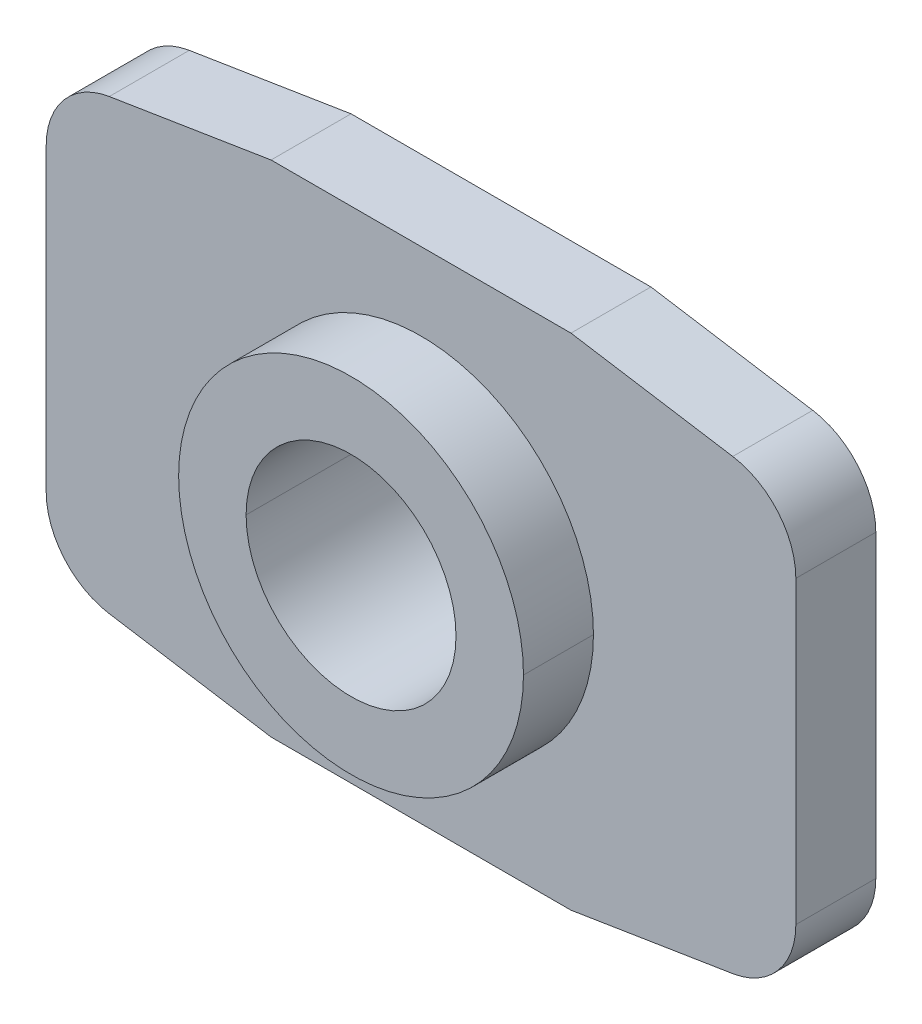
ISO-10303-21;
HEADER;
FILE_DESCRIPTION(('STEP AP214'),'2;1');
FILE_NAME('part.step','',(''),(''),'','','');
FILE_SCHEMA(('AUTOMOTIVE_DESIGN { 1 0 10303 214 1 1 1 1 }'));
ENDSEC;
DATA;
#1=APPLICATION_CONTEXT('core data for automotive mechanical design processes');
#2=APPLICATION_PROTOCOL_DEFINITION('international standard','automotive_design',2000,#1);
#3=PRODUCT_CONTEXT('',#1,'mechanical');
#4=PRODUCT('Part','Part','',(#3));
#5=PRODUCT_RELATED_PRODUCT_CATEGORY('part','',(#4));
#6=PRODUCT_DEFINITION_FORMATION('','',#4);
#7=PRODUCT_DEFINITION_CONTEXT('part definition',#1,'design');
#8=PRODUCT_DEFINITION('design','',#6,#7);
#9=PRODUCT_DEFINITION_SHAPE('','',#8);
#10=(LENGTH_UNIT() NAMED_UNIT(*) SI_UNIT(.MILLI.,.METRE.));
#11=(NAMED_UNIT(*) PLANE_ANGLE_UNIT() SI_UNIT($,.RADIAN.));
#12=(NAMED_UNIT(*) SI_UNIT($,.STERADIAN.) SOLID_ANGLE_UNIT());
#13=UNCERTAINTY_MEASURE_WITH_UNIT(LENGTH_MEASURE(1.E-05),#10,'distance_accuracy_value','');
#14=(GEOMETRIC_REPRESENTATION_CONTEXT(3) GLOBAL_UNCERTAINTY_ASSIGNED_CONTEXT((#13)) GLOBAL_UNIT_ASSIGNED_CONTEXT((#10,
#11,#12)) REPRESENTATION_CONTEXT('',''));
#15=CARTESIAN_POINT('',(0.,0.,0.));
#16=DIRECTION('',(0.,0.,1.));
#17=DIRECTION('',(1.,0.,0.));
#18=AXIS2_PLACEMENT_3D('',#15,#16,#17);
#19=CARTESIAN_POINT('',(0.,0.,3.));
#20=DIRECTION('',(0.,0.,1.));
#21=DIRECTION('',(1.,0.,0.));
#22=AXIS2_PLACEMENT_3D('',#19,#20,#21);
#23=CYLINDRICAL_SURFACE('',#22,2.1);
#24=DIRECTION('',(0.,0.,1.));
#25=VECTOR('',#24,1.);
#26=CARTESIAN_POINT('',(-2.1,0.,3.));
#27=LINE('',#26,#25);
#28=CARTESIAN_POINT('',(-2.1,0.,0.));
#29=VERTEX_POINT('',#28);
#30=CARTESIAN_POINT('',(-2.1,0.,3.));
#31=VERTEX_POINT('',#30);
#32=EDGE_CURVE('E194',#29,#31,#27,.T.);
#33=ORIENTED_EDGE('',*,*,#32,.F.);
#34=CARTESIAN_POINT('',(0.,0.,0.));
#35=DIRECTION('',(0.,0.,1.));
#36=DIRECTION('',(1.,0.,0.));
#37=AXIS2_PLACEMENT_3D('',#34,#35,#36);
#38=CIRCLE('',#37,2.1);
#39=CARTESIAN_POINT('',(2.1,0.,0.));
#40=VERTEX_POINT('',#39);
#41=EDGE_CURVE('E268',#40,#29,#38,.T.);
#42=ORIENTED_EDGE('',*,*,#41,.F.);
#43=DIRECTION('',(0.,0.,1.));
#44=VECTOR('',#43,1.);
#45=CARTESIAN_POINT('',(2.1,0.,3.));
#46=LINE('',#45,#44);
#47=CARTESIAN_POINT('',(2.1,0.,3.));
#48=VERTEX_POINT('',#47);
#49=EDGE_CURVE('E296',#40,#48,#46,.T.);
#50=ORIENTED_EDGE('',*,*,#49,.T.);
#51=CARTESIAN_POINT('',(0.,0.,3.));
#52=DIRECTION('',(0.,0.,1.));
#53=DIRECTION('',(1.,0.,0.));
#54=AXIS2_PLACEMENT_3D('',#51,#52,#53);
#55=CIRCLE('',#54,2.1);
#56=EDGE_CURVE('E10',#48,#31,#55,.T.);
#57=ORIENTED_EDGE('',*,*,#56,.T.);
#58=EDGE_LOOP('',(#33,#42,#50,#57));
#59=FACE_BOUND('',#58,.T.);
#60=ADVANCED_FACE('F16',(#59),#23,.F.);
#61=CARTESIAN_POINT('',(0.,0.,3.));
#62=DIRECTION('',(0.,0.,1.));
#63=DIRECTION('',(1.,0.,0.));
#64=AXIS2_PLACEMENT_3D('',#61,#62,#63);
#65=PLANE('',#64);
#66=ORIENTED_EDGE('',*,*,#56,.F.);
#67=CARTESIAN_POINT('',(0.,0.,3.));
#68=DIRECTION('',(0.,0.,1.));
#69=DIRECTION('',(1.,0.,0.));
#70=AXIS2_PLACEMENT_3D('',#67,#68,#69);
#71=CIRCLE('',#70,2.1);
#72=EDGE_CURVE('E292',#31,#48,#71,.T.);
#73=ORIENTED_EDGE('',*,*,#72,.F.);
#74=EDGE_LOOP('',(#66,#73));
#75=FACE_BOUND('',#74,.T.);
#76=CARTESIAN_POINT('',(0.,0.,3.));
#77=DIRECTION('',(0.,0.,1.));
#78=DIRECTION('',(1.,0.,0.));
#79=AXIS2_PLACEMENT_3D('',#76,#77,#78);
#80=CIRCLE('',#79,3.45);
#81=CARTESIAN_POINT('',(-3.45,0.,3.));
#82=VERTEX_POINT('',#81);
#83=CARTESIAN_POINT('',(3.45,0.,3.));
#84=VERTEX_POINT('',#83);
#85=EDGE_CURVE('E27',#82,#84,#80,.T.);
#86=ORIENTED_EDGE('',*,*,#85,.T.);
#87=CARTESIAN_POINT('',(0.,0.,3.));
#88=DIRECTION('',(0.,0.,1.));
#89=DIRECTION('',(1.,0.,0.));
#90=AXIS2_PLACEMENT_3D('',#87,#88,#89);
#91=CIRCLE('',#90,3.45);
#92=EDGE_CURVE('E207',#84,#82,#91,.T.);
#93=ORIENTED_EDGE('',*,*,#92,.T.);
#94=EDGE_LOOP('',(#86,#93));
#95=FACE_BOUND('',#94,.T.);
#96=ADVANCED_FACE('F398',(#75,#95),#65,.T.);
#97=CARTESIAN_POINT('',(0.,0.,3.));
#98=DIRECTION('',(0.,0.,-1.));
#99=DIRECTION('',(-1.,0.,0.));
#100=AXIS2_PLACEMENT_3D('',#97,#98,#99);
#101=CYLINDRICAL_SURFACE('',#100,3.45);
#102=DIRECTION('',(0.,0.,-1.));
#103=VECTOR('',#102,1.);
#104=CARTESIAN_POINT('',(3.45,0.,3.));
#105=LINE('',#104,#103);
#106=CARTESIAN_POINT('',(3.45,0.,1.6));
#107=VERTEX_POINT('',#106);
#108=EDGE_CURVE('E203',#84,#107,#105,.T.);
#109=ORIENTED_EDGE('',*,*,#108,.F.);
#110=ORIENTED_EDGE('',*,*,#85,.F.);
#111=DIRECTION('',(0.,0.,-1.));
#112=VECTOR('',#111,1.);
#113=CARTESIAN_POINT('',(-3.45,0.,3.));
#114=LINE('',#113,#112);
#115=CARTESIAN_POINT('',(-3.45,0.,1.6));
#116=VERTEX_POINT('',#115);
#117=EDGE_CURVE('E202',#82,#116,#114,.T.);
#118=ORIENTED_EDGE('',*,*,#117,.T.);
#119=CARTESIAN_POINT('',(0.,0.,1.6));
#120=DIRECTION('',(0.,0.,1.));
#121=DIRECTION('',(1.,0.,0.));
#122=AXIS2_PLACEMENT_3D('',#119,#120,#121);
#123=CIRCLE('',#122,3.45);
#124=EDGE_CURVE('E144',#116,#107,#123,.T.);
#125=ORIENTED_EDGE('',*,*,#124,.T.);
#126=EDGE_LOOP('',(#109,#110,#118,#125));
#127=FACE_BOUND('',#126,.T.);
#128=ADVANCED_FACE('F401',(#127),#101,.T.);
#129=CARTESIAN_POINT('',(6.,3.,0.));
#130=DIRECTION('',(0.,0.,1.));
#131=DIRECTION('',(1.,0.,0.));
#132=AXIS2_PLACEMENT_3D('',#129,#130,#131);
#133=PLANE('',#132);
#134=ORIENTED_EDGE('',*,*,#41,.T.);
#135=CARTESIAN_POINT('',(0.,0.,0.));
#136=DIRECTION('',(0.,0.,1.));
#137=DIRECTION('',(1.,0.,0.));
#138=AXIS2_PLACEMENT_3D('',#135,#136,#137);
#139=CIRCLE('',#138,2.1);
#140=EDGE_CURVE('E225',#29,#40,#139,.T.);
#141=ORIENTED_EDGE('',*,*,#140,.T.);
#142=EDGE_LOOP('',(#134,#141));
#143=FACE_BOUND('',#142,.T.);
#144=CARTESIAN_POINT('',(6.,3.,0.));
#145=DIRECTION('',(0.,0.,1.));
#146=DIRECTION('',(1.,0.,0.));
#147=AXIS2_PLACEMENT_3D('',#144,#145,#146);
#148=CIRCLE('',#147,1.5);
#149=CARTESIAN_POINT('',(7.5,3.,0.));
#150=VERTEX_POINT('',#149);
#151=CARTESIAN_POINT('',(6.23739675280407,4.48109512920612,0.));
#152=VERTEX_POINT('',#151);
#153=EDGE_CURVE('E245',#150,#152,#148,.T.);
#154=ORIENTED_EDGE('',*,*,#153,.F.);
#155=DIRECTION('',(0.,1.,0.));
#156=VECTOR('',#155,1.);
#157=CARTESIAN_POINT('',(7.5,-3.,0.));
#158=LINE('',#157,#156);
#159=CARTESIAN_POINT('',(7.5,-3.,0.));
#160=VERTEX_POINT('',#159);
#161=EDGE_CURVE('E42',#160,#150,#158,.T.);
#162=ORIENTED_EDGE('',*,*,#161,.F.);
#163=CARTESIAN_POINT('',(6.,-3.,0.));
#164=DIRECTION('',(0.,0.,1.));
#165=DIRECTION('',(-1.,0.,0.));
#166=AXIS2_PLACEMENT_3D('',#163,#164,#165);
#167=CIRCLE('',#166,1.5);
#168=CARTESIAN_POINT('',(6.23739675280407,-4.48109512920612,0.));
#169=VERTEX_POINT('',#168);
#170=EDGE_CURVE('E257',#169,#160,#167,.T.);
#171=ORIENTED_EDGE('',*,*,#170,.F.);
#172=DIRECTION('',(0.987396752804077,0.158264501869386,0.));
#173=VECTOR('',#172,1.);
#174=CARTESIAN_POINT('',(6.23739675280407,-4.48109512920612,0.));
#175=LINE('',#174,#173);
#176=CARTESIAN_POINT('',(3.,-5.,0.));
#177=VERTEX_POINT('',#176);
#178=EDGE_CURVE('E168',#177,#169,#175,.T.);
#179=ORIENTED_EDGE('',*,*,#178,.F.);
#180=DIRECTION('',(1.,0.,0.));
#181=VECTOR('',#180,1.);
#182=CARTESIAN_POINT('',(-3.,-5.,0.));
#183=LINE('',#182,#181);
#184=CARTESIAN_POINT('',(-3.,-5.,0.));
#185=VERTEX_POINT('',#184);
#186=EDGE_CURVE('E161',#185,#177,#183,.T.);
#187=ORIENTED_EDGE('',*,*,#186,.F.);
#188=DIRECTION('',(0.987396752804077,-0.158264501869385,0.));
#189=VECTOR('',#188,1.);
#190=CARTESIAN_POINT('',(-6.23739675280407,-4.48109512920612,0.));
#191=LINE('',#190,#189);
#192=CARTESIAN_POINT('',(-6.23739675280407,-4.48109512920612,0.));
#193=VERTEX_POINT('',#192);
#194=EDGE_CURVE('E165',#193,#185,#191,.T.);
#195=ORIENTED_EDGE('',*,*,#194,.F.);
#196=CARTESIAN_POINT('',(-6.,-3.,0.));
#197=DIRECTION('',(0.,0.,1.));
#198=DIRECTION('',(1.,0.,0.));
#199=AXIS2_PLACEMENT_3D('',#196,#197,#198);
#200=CIRCLE('',#199,1.5);
#201=CARTESIAN_POINT('',(-7.5,-3.,0.));
#202=VERTEX_POINT('',#201);
#203=EDGE_CURVE('E191',#202,#193,#200,.T.);
#204=ORIENTED_EDGE('',*,*,#203,.F.);
#205=DIRECTION('',(0.,-1.,0.));
#206=VECTOR('',#205,1.);
#207=CARTESIAN_POINT('',(-7.5,-3.,0.));
#208=LINE('',#207,#206);
#209=CARTESIAN_POINT('',(-7.5,3.,0.));
#210=VERTEX_POINT('',#209);
#211=EDGE_CURVE('E224',#210,#202,#208,.T.);
#212=ORIENTED_EDGE('',*,*,#211,.F.);
#213=CARTESIAN_POINT('',(-6.,3.,0.));
#214=DIRECTION('',(0.,0.,1.));
#215=DIRECTION('',(-1.,0.,0.));
#216=AXIS2_PLACEMENT_3D('',#213,#214,#215);
#217=CIRCLE('',#216,1.5);
#218=CARTESIAN_POINT('',(-6.23739675280407,4.48109512920612,0.));
#219=VERTEX_POINT('',#218);
#220=EDGE_CURVE('E308',#219,#210,#217,.T.);
#221=ORIENTED_EDGE('',*,*,#220,.F.);
#222=DIRECTION('',(-0.987396752804077,-0.158264501869386,0.));
#223=VECTOR('',#222,1.);
#224=CARTESIAN_POINT('',(-6.23739675280407,4.48109512920611,0.));
#225=LINE('',#224,#223);
#226=CARTESIAN_POINT('',(-3.,5.,0.));
#227=VERTEX_POINT('',#226);
#228=EDGE_CURVE('E276',#227,#219,#225,.T.);
#229=ORIENTED_EDGE('',*,*,#228,.F.);
#230=DIRECTION('',(-1.,0.,0.));
#231=VECTOR('',#230,1.);
#232=CARTESIAN_POINT('',(-3.,5.,0.));
#233=LINE('',#232,#231);
#234=CARTESIAN_POINT('',(3.,5.,0.));
#235=VERTEX_POINT('',#234);
#236=EDGE_CURVE('E284',#235,#227,#233,.T.);
#237=ORIENTED_EDGE('',*,*,#236,.F.);
#238=DIRECTION('',(-0.987396752804077,0.158264501869386,0.));
#239=VECTOR('',#238,1.);
#240=CARTESIAN_POINT('',(6.23739675280407,4.48109512920612,0.));
#241=LINE('',#240,#239);
#242=EDGE_CURVE('E218',#152,#235,#241,.T.);
#243=ORIENTED_EDGE('',*,*,#242,.F.);
#244=EDGE_LOOP('',(#154,#162,#171,#179,#187,#195,#204,#212,#221,#229,#237,#243));
#245=FACE_BOUND('',#244,.T.);
#246=ADVANCED_FACE('F163',(#143,#245),#133,.F.);
#247=CARTESIAN_POINT('',(7.5,-3.,1.6));
#248=DIRECTION('',(-1.,0.,0.));
#249=DIRECTION('',(0.,0.,1.));
#250=AXIS2_PLACEMENT_3D('',#247,#248,#249);
#251=PLANE('',#250);
#252=ORIENTED_EDGE('',*,*,#161,.T.);
#253=DIRECTION('',(0.,0.,-1.));
#254=VECTOR('',#253,1.);
#255=CARTESIAN_POINT('',(7.5,3.,1.6));
#256=LINE('',#255,#254);
#257=CARTESIAN_POINT('',(7.5,3.,1.6));
#258=VERTEX_POINT('',#257);
#259=EDGE_CURVE('E214',#258,#150,#256,.T.);
#260=ORIENTED_EDGE('',*,*,#259,.F.);
#261=DIRECTION('',(0.,1.,0.));
#262=VECTOR('',#261,1.);
#263=CARTESIAN_POINT('',(7.5,-3.,1.6));
#264=LINE('',#263,#262);
#265=CARTESIAN_POINT('',(7.5,-3.,1.6));
#266=VERTEX_POINT('',#265);
#267=EDGE_CURVE('E238',#266,#258,#264,.T.);
#268=ORIENTED_EDGE('',*,*,#267,.F.);
#269=DIRECTION('',(0.,0.,-1.));
#270=VECTOR('',#269,1.);
#271=CARTESIAN_POINT('',(7.5,-3.,1.6));
#272=LINE('',#271,#270);
#273=EDGE_CURVE('E261',#266,#160,#272,.T.);
#274=ORIENTED_EDGE('',*,*,#273,.T.);
#275=EDGE_LOOP('',(#252,#260,#268,#274));
#276=FACE_BOUND('',#275,.T.);
#277=ADVANCED_FACE('F369',(#276),#251,.F.);
#278=CARTESIAN_POINT('',(6.,-3.,1.6));
#279=DIRECTION('',(0.,0.,-1.));
#280=DIRECTION('',(-1.,0.,0.));
#281=AXIS2_PLACEMENT_3D('',#278,#279,#280);
#282=CYLINDRICAL_SURFACE('',#281,1.5);
#283=ORIENTED_EDGE('',*,*,#170,.T.);
#284=ORIENTED_EDGE('',*,*,#273,.F.);
#285=CARTESIAN_POINT('',(6.,-3.,1.6));
#286=DIRECTION('',(0.,0.,1.));
#287=DIRECTION('',(-1.,0.,0.));
#288=AXIS2_PLACEMENT_3D('',#285,#286,#287);
#289=CIRCLE('',#288,1.5);
#290=CARTESIAN_POINT('',(6.23739675280407,-4.48109512920612,1.6));
#291=VERTEX_POINT('',#290);
#292=EDGE_CURVE('E237',#291,#266,#289,.T.);
#293=ORIENTED_EDGE('',*,*,#292,.F.);
#294=DIRECTION('',(0.,0.,-1.));
#295=VECTOR('',#294,1.);
#296=CARTESIAN_POINT('',(6.23739675280407,-4.48109512920612,1.6));
#297=LINE('',#296,#295);
#298=EDGE_CURVE('E253',#291,#169,#297,.T.);
#299=ORIENTED_EDGE('',*,*,#298,.T.);
#300=EDGE_LOOP('',(#283,#284,#293,#299));
#301=FACE_BOUND('',#300,.T.);
#302=ADVANCED_FACE('F443',(#301),#282,.T.);
#303=CARTESIAN_POINT('',(6.23739675280407,-4.48109512920612,1.6));
#304=DIRECTION('',(-0.158264501869386,0.987396752804077,0.));
#305=DIRECTION('',(0.,0.,1.));
#306=AXIS2_PLACEMENT_3D('',#303,#304,#305);
#307=PLANE('',#306);
#308=ORIENTED_EDGE('',*,*,#178,.T.);
#309=ORIENTED_EDGE('',*,*,#298,.F.);
#310=DIRECTION('',(0.987396752804077,0.158264501869386,0.));
#311=VECTOR('',#310,1.);
#312=CARTESIAN_POINT('',(6.23739675280407,-4.48109512920612,1.6));
#313=LINE('',#312,#311);
#314=CARTESIAN_POINT('',(3.,-5.,1.6));
#315=VERTEX_POINT('',#314);
#316=EDGE_CURVE('E233',#315,#291,#313,.T.);
#317=ORIENTED_EDGE('',*,*,#316,.F.);
#318=DIRECTION('',(0.,0.,-1.));
#319=VECTOR('',#318,1.);
#320=CARTESIAN_POINT('',(3.,-5.,1.6));
#321=LINE('',#320,#319);
#322=EDGE_CURVE('E172',#315,#177,#321,.T.);
#323=ORIENTED_EDGE('',*,*,#322,.T.);
#324=EDGE_LOOP('',(#308,#309,#317,#323));
#325=FACE_BOUND('',#324,.T.);
#326=ADVANCED_FACE('F441',(#325),#307,.F.);
#327=CARTESIAN_POINT('',(-3.,-5.,1.6));
#328=DIRECTION('',(0.,1.,0.));
#329=DIRECTION('',(1.,0.,0.));
#330=AXIS2_PLACEMENT_3D('',#327,#328,#329);
#331=PLANE('',#330);
#332=ORIENTED_EDGE('',*,*,#186,.T.);
#333=ORIENTED_EDGE('',*,*,#322,.F.);
#334=DIRECTION('',(1.,0.,0.));
#335=VECTOR('',#334,1.);
#336=CARTESIAN_POINT('',(-3.,-5.,1.6));
#337=LINE('',#336,#335);
#338=CARTESIAN_POINT('',(-3.,-5.,1.6));
#339=VERTEX_POINT('',#338);
#340=EDGE_CURVE('E177',#339,#315,#337,.T.);
#341=ORIENTED_EDGE('',*,*,#340,.F.);
#342=DIRECTION('',(0.,0.,-1.));
#343=VECTOR('',#342,1.);
#344=CARTESIAN_POINT('',(-3.,-5.,1.6));
#345=LINE('',#344,#343);
#346=EDGE_CURVE('E173',#339,#185,#345,.T.);
#347=ORIENTED_EDGE('',*,*,#346,.T.);
#348=EDGE_LOOP('',(#332,#333,#341,#347));
#349=FACE_BOUND('',#348,.T.);
#350=ADVANCED_FACE('F18',(#349),#331,.F.);
#351=CARTESIAN_POINT('',(-6.23739675280407,-4.48109512920612,1.6));
#352=DIRECTION('',(0.158264501869385,0.987396752804077,0.));
#353=DIRECTION('',(0.,0.,-1.));
#354=AXIS2_PLACEMENT_3D('',#351,#352,#353);
#355=PLANE('',#354);
#356=ORIENTED_EDGE('',*,*,#194,.T.);
#357=ORIENTED_EDGE('',*,*,#346,.F.);
#358=DIRECTION('',(0.987396752804077,-0.158264501869385,0.));
#359=VECTOR('',#358,1.);
#360=CARTESIAN_POINT('',(-6.23739675280407,-4.48109512920612,1.6));
#361=LINE('',#360,#359);
#362=CARTESIAN_POINT('',(-6.23739675280407,-4.48109512920612,1.6));
#363=VERTEX_POINT('',#362);
#364=EDGE_CURVE('E275',#363,#339,#361,.T.);
#365=ORIENTED_EDGE('',*,*,#364,.F.);
#366=DIRECTION('',(0.,0.,-1.));
#367=VECTOR('',#366,1.);
#368=CARTESIAN_POINT('',(-6.23739675280407,-4.48109512920612,1.6));
#369=LINE('',#368,#367);
#370=EDGE_CURVE('E20',#363,#193,#369,.T.);
#371=ORIENTED_EDGE('',*,*,#370,.T.);
#372=EDGE_LOOP('',(#356,#357,#365,#371));
#373=FACE_BOUND('',#372,.T.);
#374=ADVANCED_FACE('F183',(#373),#355,.F.);
#375=CARTESIAN_POINT('',(-6.,-3.,1.6));
#376=DIRECTION('',(0.,0.,-1.));
#377=DIRECTION('',(-1.,0.,0.));
#378=AXIS2_PLACEMENT_3D('',#375,#376,#377);
#379=CYLINDRICAL_SURFACE('',#378,1.5);
#380=ORIENTED_EDGE('',*,*,#203,.T.);
#381=ORIENTED_EDGE('',*,*,#370,.F.);
#382=CARTESIAN_POINT('',(-6.,-3.,1.6));
#383=DIRECTION('',(0.,0.,1.));
#384=DIRECTION('',(1.,0.,0.));
#385=AXIS2_PLACEMENT_3D('',#382,#383,#384);
#386=CIRCLE('',#385,1.5);
#387=CARTESIAN_POINT('',(-7.5,-3.,1.6));
#388=VERTEX_POINT('',#387);
#389=EDGE_CURVE('E212',#388,#363,#386,.T.);
#390=ORIENTED_EDGE('',*,*,#389,.F.);
#391=DIRECTION('',(0.,0.,-1.));
#392=VECTOR('',#391,1.);
#393=CARTESIAN_POINT('',(-7.5,-3.,1.6));
#394=LINE('',#393,#392);
#395=EDGE_CURVE('E220',#388,#202,#394,.T.);
#396=ORIENTED_EDGE('',*,*,#395,.T.);
#397=EDGE_LOOP('',(#380,#381,#390,#396));
#398=FACE_BOUND('',#397,.T.);
#399=ADVANCED_FACE('F347',(#398),#379,.T.);
#400=CARTESIAN_POINT('',(-7.5,-3.,1.6));
#401=DIRECTION('',(1.,0.,0.));
#402=DIRECTION('',(0.,1.,0.));
#403=AXIS2_PLACEMENT_3D('',#400,#401,#402);
#404=PLANE('',#403);
#405=ORIENTED_EDGE('',*,*,#211,.T.);
#406=ORIENTED_EDGE('',*,*,#395,.F.);
#407=DIRECTION('',(0.,-1.,0.));
#408=VECTOR('',#407,1.);
#409=CARTESIAN_POINT('',(-7.5,-3.,1.6));
#410=LINE('',#409,#408);
#411=CARTESIAN_POINT('',(-7.5,3.,1.6));
#412=VERTEX_POINT('',#411);
#413=EDGE_CURVE('E208',#412,#388,#410,.T.);
#414=ORIENTED_EDGE('',*,*,#413,.F.);
#415=DIRECTION('',(0.,0.,-1.));
#416=VECTOR('',#415,1.);
#417=CARTESIAN_POINT('',(-7.5,3.,1.6));
#418=LINE('',#417,#416);
#419=EDGE_CURVE('E252',#412,#210,#418,.T.);
#420=ORIENTED_EDGE('',*,*,#419,.T.);
#421=EDGE_LOOP('',(#405,#406,#414,#420));
#422=FACE_BOUND('',#421,.T.);
#423=ADVANCED_FACE('F429',(#422),#404,.F.);
#424=CARTESIAN_POINT('',(-6.,3.,1.6));
#425=DIRECTION('',(0.,0.,-1.));
#426=DIRECTION('',(-1.,0.,0.));
#427=AXIS2_PLACEMENT_3D('',#424,#425,#426);
#428=CYLINDRICAL_SURFACE('',#427,1.5);
#429=ORIENTED_EDGE('',*,*,#220,.T.);
#430=ORIENTED_EDGE('',*,*,#419,.F.);
#431=CARTESIAN_POINT('',(-6.,3.,1.6));
#432=DIRECTION('',(0.,0.,1.));
#433=DIRECTION('',(-1.,0.,0.));
#434=AXIS2_PLACEMENT_3D('',#431,#432,#433);
#435=CIRCLE('',#434,1.5);
#436=CARTESIAN_POINT('',(-6.23739675280407,4.48109512920612,1.6));
#437=VERTEX_POINT('',#436);
#438=EDGE_CURVE('E213',#437,#412,#435,.T.);
#439=ORIENTED_EDGE('',*,*,#438,.F.);
#440=DIRECTION('',(0.,0.,-1.));
#441=VECTOR('',#440,1.);
#442=CARTESIAN_POINT('',(-6.23739675280407,4.48109512920612,1.6));
#443=LINE('',#442,#441);
#444=EDGE_CURVE('E279',#437,#219,#443,.T.);
#445=ORIENTED_EDGE('',*,*,#444,.T.);
#446=EDGE_LOOP('',(#429,#430,#439,#445));
#447=FACE_BOUND('',#446,.T.);
#448=ADVANCED_FACE('F426',(#447),#428,.T.);
#449=CARTESIAN_POINT('',(-6.23739675280407,4.48109512920611,1.6));
#450=DIRECTION('',(0.158264501869386,-0.987396752804077,0.));
#451=DIRECTION('',(0.,0.,-1.));
#452=AXIS2_PLACEMENT_3D('',#449,#450,#451);
#453=PLANE('',#452);
#454=ORIENTED_EDGE('',*,*,#228,.T.);
#455=ORIENTED_EDGE('',*,*,#444,.F.);
#456=DIRECTION('',(-0.987396752804077,-0.158264501869386,0.));
#457=VECTOR('',#456,1.);
#458=CARTESIAN_POINT('',(-6.23739675280407,4.48109512920611,1.6));
#459=LINE('',#458,#457);
#460=CARTESIAN_POINT('',(-3.,5.,1.6));
#461=VERTEX_POINT('',#460);
#462=EDGE_CURVE('E232',#461,#437,#459,.T.);
#463=ORIENTED_EDGE('',*,*,#462,.F.);
#464=DIRECTION('',(0.,0.,-1.));
#465=VECTOR('',#464,1.);
#466=CARTESIAN_POINT('',(-3.,5.,1.6));
#467=LINE('',#466,#465);
#468=EDGE_CURVE('E280',#461,#227,#467,.T.);
#469=ORIENTED_EDGE('',*,*,#468,.T.);
#470=EDGE_LOOP('',(#454,#455,#463,#469));
#471=FACE_BOUND('',#470,.T.);
#472=ADVANCED_FACE('F384',(#471),#453,.F.);
#473=CARTESIAN_POINT('',(-3.,5.,1.6));
#474=DIRECTION('',(0.,-1.,0.));
#475=DIRECTION('',(0.,0.,-1.));
#476=AXIS2_PLACEMENT_3D('',#473,#474,#475);
#477=PLANE('',#476);
#478=ORIENTED_EDGE('',*,*,#236,.T.);
#479=ORIENTED_EDGE('',*,*,#468,.F.);
#480=DIRECTION('',(-1.,0.,0.));
#481=VECTOR('',#480,1.);
#482=CARTESIAN_POINT('',(-3.,5.,1.6));
#483=LINE('',#482,#481);
#484=CARTESIAN_POINT('',(3.,5.,1.6));
#485=VERTEX_POINT('',#484);
#486=EDGE_CURVE('E291',#485,#461,#483,.T.);
#487=ORIENTED_EDGE('',*,*,#486,.F.);
#488=DIRECTION('',(0.,0.,-1.));
#489=VECTOR('',#488,1.);
#490=CARTESIAN_POINT('',(3.,5.,1.6));
#491=LINE('',#490,#489);
#492=EDGE_CURVE('E272',#485,#235,#491,.T.);
#493=ORIENTED_EDGE('',*,*,#492,.T.);
#494=EDGE_LOOP('',(#478,#479,#487,#493));
#495=FACE_BOUND('',#494,.T.);
#496=ADVANCED_FACE('F382',(#495),#477,.F.);
#497=CARTESIAN_POINT('',(6.23739675280407,4.48109512920612,1.6));
#498=DIRECTION('',(-0.158264501869386,-0.987396752804077,0.));
#499=DIRECTION('',(-0.987396752804077,0.158264501869386,0.));
#500=AXIS2_PLACEMENT_3D('',#497,#498,#499);
#501=PLANE('',#500);
#502=ORIENTED_EDGE('',*,*,#242,.T.);
#503=ORIENTED_EDGE('',*,*,#492,.F.);
#504=DIRECTION('',(-0.987396752804077,0.158264501869386,0.));
#505=VECTOR('',#504,1.);
#506=CARTESIAN_POINT('',(6.23739675280407,4.48109512920612,1.6));
#507=LINE('',#506,#505);
#508=CARTESIAN_POINT('',(6.23739675280407,4.48109512920612,1.6));
#509=VERTEX_POINT('',#508);
#510=EDGE_CURVE('E265',#509,#485,#507,.T.);
#511=ORIENTED_EDGE('',*,*,#510,.F.);
#512=DIRECTION('',(0.,0.,-1.));
#513=VECTOR('',#512,1.);
#514=CARTESIAN_POINT('',(6.23739675280407,4.48109512920612,1.6));
#515=LINE('',#514,#513);
#516=EDGE_CURVE('E219',#509,#152,#515,.T.);
#517=ORIENTED_EDGE('',*,*,#516,.T.);
#518=EDGE_LOOP('',(#502,#503,#511,#517));
#519=FACE_BOUND('',#518,.T.);
#520=ADVANCED_FACE('F376',(#519),#501,.F.);
#521=CARTESIAN_POINT('',(6.,3.,1.6));
#522=DIRECTION('',(0.,0.,-1.));
#523=DIRECTION('',(-1.,0.,0.));
#524=AXIS2_PLACEMENT_3D('',#521,#522,#523);
#525=CYLINDRICAL_SURFACE('',#524,1.5);
#526=ORIENTED_EDGE('',*,*,#153,.T.);
#527=ORIENTED_EDGE('',*,*,#516,.F.);
#528=CARTESIAN_POINT('',(6.,3.,1.6));
#529=DIRECTION('',(0.,0.,1.));
#530=DIRECTION('',(1.,0.,0.));
#531=AXIS2_PLACEMENT_3D('',#528,#529,#530);
#532=CIRCLE('',#531,1.5);
#533=EDGE_CURVE('E248',#258,#509,#532,.T.);
#534=ORIENTED_EDGE('',*,*,#533,.F.);
#535=ORIENTED_EDGE('',*,*,#259,.T.);
#536=EDGE_LOOP('',(#526,#527,#534,#535));
#537=FACE_BOUND('',#536,.T.);
#538=ADVANCED_FACE('F373',(#537),#525,.T.);
#539=CARTESIAN_POINT('',(6.,3.,1.6));
#540=DIRECTION('',(0.,0.,1.));
#541=DIRECTION('',(1.,0.,0.));
#542=AXIS2_PLACEMENT_3D('',#539,#540,#541);
#543=PLANE('',#542);
#544=ORIENTED_EDGE('',*,*,#124,.F.);
#545=CARTESIAN_POINT('',(0.,0.,1.6));
#546=DIRECTION('',(0.,0.,1.));
#547=DIRECTION('',(1.,0.,0.));
#548=AXIS2_PLACEMENT_3D('',#545,#546,#547);
#549=CIRCLE('',#548,3.45);
#550=EDGE_CURVE('E198',#107,#116,#549,.T.);
#551=ORIENTED_EDGE('',*,*,#550,.F.);
#552=EDGE_LOOP('',(#544,#551));
#553=FACE_BOUND('',#552,.T.);
#554=ORIENTED_EDGE('',*,*,#533,.T.);
#555=ORIENTED_EDGE('',*,*,#510,.T.);
#556=ORIENTED_EDGE('',*,*,#486,.T.);
#557=ORIENTED_EDGE('',*,*,#462,.T.);
#558=ORIENTED_EDGE('',*,*,#438,.T.);
#559=ORIENTED_EDGE('',*,*,#413,.T.);
#560=ORIENTED_EDGE('',*,*,#389,.T.);
#561=ORIENTED_EDGE('',*,*,#364,.T.);
#562=ORIENTED_EDGE('',*,*,#340,.T.);
#563=ORIENTED_EDGE('',*,*,#316,.T.);
#564=ORIENTED_EDGE('',*,*,#292,.T.);
#565=ORIENTED_EDGE('',*,*,#267,.T.);
#566=EDGE_LOOP('',(#554,#555,#556,#557,#558,#559,#560,#561,#562,#563,#564,#565));
#567=FACE_BOUND('',#566,.T.);
#568=ADVANCED_FACE('F341',(#553,#567),#543,.T.);
#569=CARTESIAN_POINT('',(0.,0.,3.));
#570=DIRECTION('',(0.,0.,-1.));
#571=DIRECTION('',(-1.,0.,0.));
#572=AXIS2_PLACEMENT_3D('',#569,#570,#571);
#573=CYLINDRICAL_SURFACE('',#572,3.45);
#574=ORIENTED_EDGE('',*,*,#92,.F.);
#575=ORIENTED_EDGE('',*,*,#108,.T.);
#576=ORIENTED_EDGE('',*,*,#550,.T.);
#577=ORIENTED_EDGE('',*,*,#117,.F.);
#578=EDGE_LOOP('',(#574,#575,#576,#577));
#579=FACE_BOUND('',#578,.T.);
#580=ADVANCED_FACE('F405',(#579),#573,.T.);
#581=CARTESIAN_POINT('',(0.,0.,3.));
#582=DIRECTION('',(0.,0.,1.));
#583=DIRECTION('',(1.,0.,0.));
#584=AXIS2_PLACEMENT_3D('',#581,#582,#583);
#585=CYLINDRICAL_SURFACE('',#584,2.1);
#586=ORIENTED_EDGE('',*,*,#140,.F.);
#587=ORIENTED_EDGE('',*,*,#32,.T.);
#588=ORIENTED_EDGE('',*,*,#72,.T.);
#589=ORIENTED_EDGE('',*,*,#49,.F.);
#590=EDGE_LOOP('',(#586,#587,#588,#589));
#591=FACE_BOUND('',#590,.T.);
#592=ADVANCED_FACE('F397',(#591),#585,.F.);
#593=CLOSED_SHELL('',(#60,#96,#128,#246,#277,#302,#326,#350,#374,#399,#423,#448,#472,#496,#520,
#538,#568,#580,#592));
#594=MANIFOLD_SOLID_BREP('B1',#593);
#595=ADVANCED_BREP_SHAPE_REPRESENTATION('',(#18,#594),#14);
#596=SHAPE_DEFINITION_REPRESENTATION(#9,#595);
ENDSEC;
END-ISO-10303-21;
